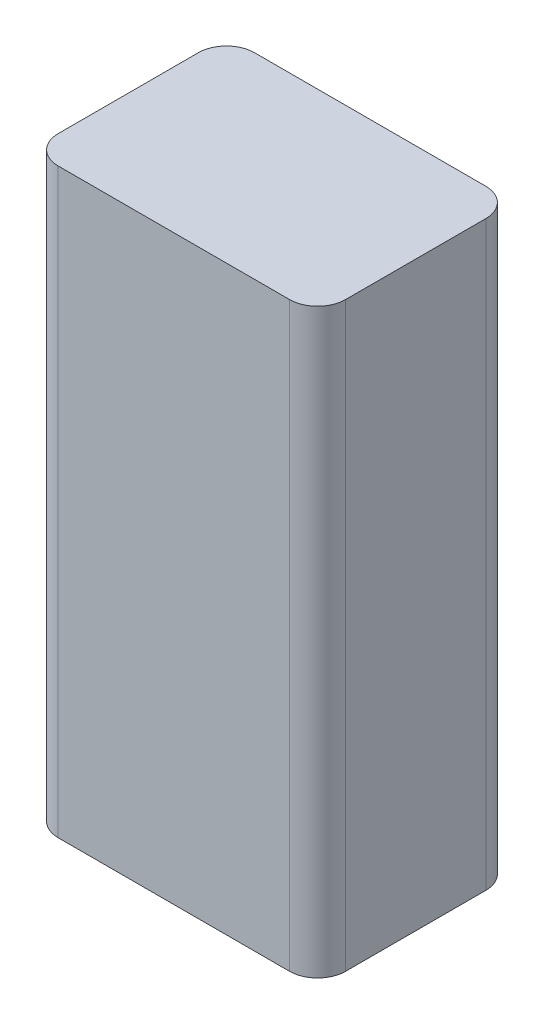
ISO-10303-21;
HEADER;
FILE_DESCRIPTION(('STEP AP214'),'2;1');
FILE_NAME('part.step','',(''),(''),'','','');
FILE_SCHEMA(('AUTOMOTIVE_DESIGN { 1 0 10303 214 1 1 1 1 }'));
ENDSEC;
DATA;
#1=APPLICATION_CONTEXT('core data for automotive mechanical design processes');
#2=APPLICATION_PROTOCOL_DEFINITION('international standard','automotive_design',2000,#1);
#3=PRODUCT_CONTEXT('',#1,'mechanical');
#4=PRODUCT('Part','Part','',(#3));
#5=PRODUCT_RELATED_PRODUCT_CATEGORY('part','',(#4));
#6=PRODUCT_DEFINITION_FORMATION('','',#4);
#7=PRODUCT_DEFINITION_CONTEXT('part definition',#1,'design');
#8=PRODUCT_DEFINITION('design','',#6,#7);
#9=PRODUCT_DEFINITION_SHAPE('','',#8);
#10=(LENGTH_UNIT() NAMED_UNIT(*) SI_UNIT(.MILLI.,.METRE.));
#11=(NAMED_UNIT(*) PLANE_ANGLE_UNIT() SI_UNIT($,.RADIAN.));
#12=(NAMED_UNIT(*) SI_UNIT($,.STERADIAN.) SOLID_ANGLE_UNIT());
#13=UNCERTAINTY_MEASURE_WITH_UNIT(LENGTH_MEASURE(1.E-05),#10,'distance_accuracy_value','');
#14=(GEOMETRIC_REPRESENTATION_CONTEXT(3) GLOBAL_UNCERTAINTY_ASSIGNED_CONTEXT((#13)) GLOBAL_UNIT_ASSIGNED_CONTEXT((#10,
#11,#12)) REPRESENTATION_CONTEXT('',''));
#15=CARTESIAN_POINT('',(0.,0.,0.));
#16=DIRECTION('',(0.,0.,1.));
#17=DIRECTION('',(1.,0.,0.));
#18=AXIS2_PLACEMENT_3D('',#15,#16,#17);
#19=CARTESIAN_POINT('',(0.,0.,17.78));
#20=DIRECTION('',(1.,0.,0.));
#21=DIRECTION('',(0.,1.,0.));
#22=AXIS2_PLACEMENT_3D('',#19,#20,#21);
#23=PLANE('',#22);
#24=DIRECTION('',(0.,0.,-1.));
#25=VECTOR('',#24,1.);
#26=CARTESIAN_POINT('',(0.,0.,17.78));
#27=LINE('',#26,#25);
#28=CARTESIAN_POINT('',(0.,0.,15.24));
#29=VERTEX_POINT('',#28);
#30=CARTESIAN_POINT('',(0.,0.,2.54));
#31=VERTEX_POINT('',#30);
#32=EDGE_CURVE('E150',#29,#31,#27,.T.);
#33=ORIENTED_EDGE('',*,*,#32,.T.);
#34=DIRECTION('',(0.,-1.,0.));
#35=VECTOR('',#34,1.);
#36=CARTESIAN_POINT('',(0.,0.,2.54));
#37=LINE('',#36,#35);
#38=CARTESIAN_POINT('',(0.,-52.705,2.54));
#39=VERTEX_POINT('',#38);
#40=EDGE_CURVE('E112',#31,#39,#37,.T.);
#41=ORIENTED_EDGE('',*,*,#40,.T.);
#42=DIRECTION('',(0.,0.,-1.));
#43=VECTOR('',#42,1.);
#44=CARTESIAN_POINT('',(0.,-52.705,17.78));
#45=LINE('',#44,#43);
#46=CARTESIAN_POINT('',(0.,-52.705,15.24));
#47=VERTEX_POINT('',#46);
#48=EDGE_CURVE('E104',#47,#39,#45,.T.);
#49=ORIENTED_EDGE('',*,*,#48,.F.);
#50=DIRECTION('',(0.,-1.,0.));
#51=VECTOR('',#50,1.);
#52=CARTESIAN_POINT('',(0.,0.,15.24));
#53=LINE('',#52,#51);
#54=EDGE_CURVE('E117',#47,#29,#53,.F.);
#55=ORIENTED_EDGE('',*,*,#54,.T.);
#56=EDGE_LOOP('',(#33,#41,#49,#55));
#57=FACE_BOUND('',#56,.T.);
#58=ADVANCED_FACE('F34',(#57),#23,.F.);
#59=CARTESIAN_POINT('',(0.,-52.705,17.78));
#60=DIRECTION('',(0.,1.,0.));
#61=DIRECTION('',(0.,0.,1.));
#62=AXIS2_PLACEMENT_3D('',#59,#60,#61);
#63=PLANE('',#62);
#64=ORIENTED_EDGE('',*,*,#48,.T.);
#65=CARTESIAN_POINT('',(2.54000000000002,-52.705,2.54));
#66=DIRECTION('',(0.,1.,0.));
#67=DIRECTION('',(0.,0.,1.));
#68=AXIS2_PLACEMENT_3D('',#65,#66,#67);
#69=CIRCLE('',#68,2.54);
#70=CARTESIAN_POINT('',(2.54000000000002,-52.705,0.));
#71=VERTEX_POINT('',#70);
#72=EDGE_CURVE('E131',#39,#71,#69,.F.);
#73=ORIENTED_EDGE('',*,*,#72,.T.);
#74=DIRECTION('',(1.,0.,0.));
#75=VECTOR('',#74,1.);
#76=CARTESIAN_POINT('',(0.,-52.705,0.));
#77=LINE('',#76,#75);
#78=CARTESIAN_POINT('',(23.495,-52.705,0.));
#79=VERTEX_POINT('',#78);
#80=EDGE_CURVE('E157',#71,#79,#77,.T.);
#81=ORIENTED_EDGE('',*,*,#80,.T.);
#82=CARTESIAN_POINT('',(23.495,-52.705,2.54));
#83=DIRECTION('',(0.,1.,0.));
#84=DIRECTION('',(0.,0.,1.));
#85=AXIS2_PLACEMENT_3D('',#82,#83,#84);
#86=CIRCLE('',#85,2.54);
#87=CARTESIAN_POINT('',(26.035,-52.705,2.54));
#88=VERTEX_POINT('',#87);
#89=EDGE_CURVE('E129',#79,#88,#86,.F.);
#90=ORIENTED_EDGE('',*,*,#89,.T.);
#91=DIRECTION('',(0.,0.,-1.));
#92=VECTOR('',#91,1.);
#93=CARTESIAN_POINT('',(26.035,-52.705,17.78));
#94=LINE('',#93,#92);
#95=CARTESIAN_POINT('',(26.035,-52.705,15.24));
#96=VERTEX_POINT('',#95);
#97=EDGE_CURVE('E120',#96,#88,#94,.T.);
#98=ORIENTED_EDGE('',*,*,#97,.F.);
#99=CARTESIAN_POINT('',(23.495,-52.705,15.24));
#100=DIRECTION('',(0.,1.,0.));
#101=DIRECTION('',(0.,0.,1.));
#102=AXIS2_PLACEMENT_3D('',#99,#100,#101);
#103=CIRCLE('',#102,2.54);
#104=CARTESIAN_POINT('',(23.495,-52.705,17.78));
#105=VERTEX_POINT('',#104);
#106=EDGE_CURVE('E111',#96,#105,#103,.F.);
#107=ORIENTED_EDGE('',*,*,#106,.T.);
#108=DIRECTION('',(1.,0.,0.));
#109=VECTOR('',#108,1.);
#110=CARTESIAN_POINT('',(0.,-52.705,17.78));
#111=LINE('',#110,#109);
#112=CARTESIAN_POINT('',(2.54000000000002,-52.705,17.78));
#113=VERTEX_POINT('',#112);
#114=EDGE_CURVE('E106',#113,#105,#111,.T.);
#115=ORIENTED_EDGE('',*,*,#114,.F.);
#116=CARTESIAN_POINT('',(2.54000000000002,-52.705,15.24));
#117=DIRECTION('',(0.,1.,0.));
#118=DIRECTION('',(0.,0.,1.));
#119=AXIS2_PLACEMENT_3D('',#116,#117,#118);
#120=CIRCLE('',#119,2.54);
#121=EDGE_CURVE('E101',#113,#47,#120,.F.);
#122=ORIENTED_EDGE('',*,*,#121,.T.);
#123=EDGE_LOOP('',(#64,#73,#81,#90,#98,#107,#115,#122));
#124=FACE_BOUND('',#123,.T.);
#125=ADVANCED_FACE('F103',(#124),#63,.F.);
#126=CARTESIAN_POINT('',(26.035,0.,17.78));
#127=DIRECTION('',(-1.,0.,0.));
#128=DIRECTION('',(0.,-1.,0.));
#129=AXIS2_PLACEMENT_3D('',#126,#127,#128);
#130=PLANE('',#129);
#131=ORIENTED_EDGE('',*,*,#97,.T.);
#132=DIRECTION('',(0.,1.,0.));
#133=VECTOR('',#132,1.);
#134=CARTESIAN_POINT('',(26.035,0.,2.54));
#135=LINE('',#134,#133);
#136=CARTESIAN_POINT('',(26.035,0.,2.54));
#137=VERTEX_POINT('',#136);
#138=EDGE_CURVE('E144',#88,#137,#135,.T.);
#139=ORIENTED_EDGE('',*,*,#138,.T.);
#140=DIRECTION('',(0.,0.,-1.));
#141=VECTOR('',#140,1.);
#142=CARTESIAN_POINT('',(26.035,0.,17.78));
#143=LINE('',#142,#141);
#144=CARTESIAN_POINT('',(26.035,0.,15.24));
#145=VERTEX_POINT('',#144);
#146=EDGE_CURVE('E152',#145,#137,#143,.T.);
#147=ORIENTED_EDGE('',*,*,#146,.F.);
#148=DIRECTION('',(0.,1.,0.));
#149=VECTOR('',#148,1.);
#150=CARTESIAN_POINT('',(26.035,-52.705,15.24));
#151=LINE('',#150,#149);
#152=EDGE_CURVE('E142',#145,#96,#151,.F.);
#153=ORIENTED_EDGE('',*,*,#152,.T.);
#154=EDGE_LOOP('',(#131,#139,#147,#153));
#155=FACE_BOUND('',#154,.T.);
#156=ADVANCED_FACE('F165',(#155),#130,.F.);
#157=CARTESIAN_POINT('',(0.,0.,17.78));
#158=DIRECTION('',(0.,-1.,0.));
#159=DIRECTION('',(0.,0.,-1.));
#160=AXIS2_PLACEMENT_3D('',#157,#158,#159);
#161=PLANE('',#160);
#162=DIRECTION('',(-1.,0.,0.));
#163=VECTOR('',#162,1.);
#164=CARTESIAN_POINT('',(0.,0.,0.));
#165=LINE('',#164,#163);
#166=CARTESIAN_POINT('',(23.495,0.,0.));
#167=VERTEX_POINT('',#166);
#168=CARTESIAN_POINT('',(2.54,0.,0.));
#169=VERTEX_POINT('',#168);
#170=EDGE_CURVE('E154',#167,#169,#165,.T.);
#171=ORIENTED_EDGE('',*,*,#170,.T.);
#172=CARTESIAN_POINT('',(2.54,0.,2.54));
#173=DIRECTION('',(0.,-1.,0.));
#174=DIRECTION('',(0.,0.,-1.));
#175=AXIS2_PLACEMENT_3D('',#172,#173,#174);
#176=CIRCLE('',#175,2.54);
#177=EDGE_CURVE('E140',#169,#31,#176,.F.);
#178=ORIENTED_EDGE('',*,*,#177,.T.);
#179=ORIENTED_EDGE('',*,*,#32,.F.);
#180=CARTESIAN_POINT('',(2.54,0.,15.24));
#181=DIRECTION('',(0.,-1.,0.));
#182=DIRECTION('',(0.,0.,-1.));
#183=AXIS2_PLACEMENT_3D('',#180,#181,#182);
#184=CIRCLE('',#183,2.54);
#185=CARTESIAN_POINT('',(2.54,0.,17.78));
#186=VERTEX_POINT('',#185);
#187=EDGE_CURVE('E123',#29,#186,#184,.F.);
#188=ORIENTED_EDGE('',*,*,#187,.T.);
#189=DIRECTION('',(-1.,0.,0.));
#190=VECTOR('',#189,1.);
#191=CARTESIAN_POINT('',(0.,0.,17.78));
#192=LINE('',#191,#190);
#193=CARTESIAN_POINT('',(23.495,0.,17.78));
#194=VERTEX_POINT('',#193);
#195=EDGE_CURVE('E149',#194,#186,#192,.T.);
#196=ORIENTED_EDGE('',*,*,#195,.F.);
#197=CARTESIAN_POINT('',(23.495,0.,15.24));
#198=DIRECTION('',(0.,-1.,0.));
#199=DIRECTION('',(0.,0.,-1.));
#200=AXIS2_PLACEMENT_3D('',#197,#198,#199);
#201=CIRCLE('',#200,2.54);
#202=EDGE_CURVE('E57',#194,#145,#201,.F.);
#203=ORIENTED_EDGE('',*,*,#202,.T.);
#204=ORIENTED_EDGE('',*,*,#146,.T.);
#205=CARTESIAN_POINT('',(23.495,0.,2.54));
#206=DIRECTION('',(0.,-1.,0.));
#207=DIRECTION('',(0.,0.,-1.));
#208=AXIS2_PLACEMENT_3D('',#205,#206,#207);
#209=CIRCLE('',#208,2.54);
#210=EDGE_CURVE('E49',#137,#167,#209,.F.);
#211=ORIENTED_EDGE('',*,*,#210,.T.);
#212=EDGE_LOOP('',(#171,#178,#179,#188,#196,#203,#204,#211));
#213=FACE_BOUND('',#212,.T.);
#214=ADVANCED_FACE('F178',(#213),#161,.F.);
#215=CARTESIAN_POINT('',(0.,0.,17.78));
#216=DIRECTION('',(0.,0.,1.));
#217=DIRECTION('',(1.,0.,0.));
#218=AXIS2_PLACEMENT_3D('',#215,#216,#217);
#219=PLANE('',#218);
#220=ORIENTED_EDGE('',*,*,#114,.T.);
#221=DIRECTION('',(0.,1.,0.));
#222=VECTOR('',#221,1.);
#223=CARTESIAN_POINT('',(23.495,0.,17.78));
#224=LINE('',#223,#222);
#225=EDGE_CURVE('E11',#105,#194,#224,.T.);
#226=ORIENTED_EDGE('',*,*,#225,.T.);
#227=ORIENTED_EDGE('',*,*,#195,.T.);
#228=DIRECTION('',(0.,-1.,0.));
#229=VECTOR('',#228,1.);
#230=CARTESIAN_POINT('',(2.54000000000002,-52.705,17.78));
#231=LINE('',#230,#229);
#232=EDGE_CURVE('E42',#186,#113,#231,.T.);
#233=ORIENTED_EDGE('',*,*,#232,.T.);
#234=EDGE_LOOP('',(#220,#226,#227,#233));
#235=FACE_BOUND('',#234,.T.);
#236=ADVANCED_FACE('F147',(#235),#219,.T.);
#237=CARTESIAN_POINT('',(0.,0.,0.));
#238=DIRECTION('',(0.,0.,1.));
#239=DIRECTION('',(1.,0.,0.));
#240=AXIS2_PLACEMENT_3D('',#237,#238,#239);
#241=PLANE('',#240);
#242=ORIENTED_EDGE('',*,*,#80,.F.);
#243=DIRECTION('',(0.,-1.,0.));
#244=VECTOR('',#243,1.);
#245=CARTESIAN_POINT('',(2.54,0.,0.));
#246=LINE('',#245,#244);
#247=EDGE_CURVE('E135',#71,#169,#246,.F.);
#248=ORIENTED_EDGE('',*,*,#247,.T.);
#249=ORIENTED_EDGE('',*,*,#170,.F.);
#250=DIRECTION('',(0.,1.,0.));
#251=VECTOR('',#250,1.);
#252=CARTESIAN_POINT('',(23.495,0.,0.));
#253=LINE('',#252,#251);
#254=EDGE_CURVE('E133',#167,#79,#253,.F.);
#255=ORIENTED_EDGE('',*,*,#254,.T.);
#256=EDGE_LOOP('',(#242,#248,#249,#255));
#257=FACE_BOUND('',#256,.T.);
#258=ADVANCED_FACE('F173',(#257),#241,.F.);
#259=CARTESIAN_POINT('',(2.54,0.,2.54));
#260=DIRECTION('',(0.,-1.,0.));
#261=DIRECTION('',(1.,0.,0.));
#262=AXIS2_PLACEMENT_3D('',#259,#260,#261);
#263=CYLINDRICAL_SURFACE('',#262,2.54);
#264=ORIENTED_EDGE('',*,*,#177,.F.);
#265=ORIENTED_EDGE('',*,*,#247,.F.);
#266=ORIENTED_EDGE('',*,*,#72,.F.);
#267=ORIENTED_EDGE('',*,*,#40,.F.);
#268=EDGE_LOOP('',(#264,#265,#266,#267));
#269=FACE_BOUND('',#268,.T.);
#270=ADVANCED_FACE('F177',(#269),#263,.T.);
#271=CARTESIAN_POINT('',(23.495,0.,2.54));
#272=DIRECTION('',(0.,1.,0.));
#273=DIRECTION('',(-1.,0.,0.));
#274=AXIS2_PLACEMENT_3D('',#271,#272,#273);
#275=CYLINDRICAL_SURFACE('',#274,2.54);
#276=ORIENTED_EDGE('',*,*,#89,.F.);
#277=ORIENTED_EDGE('',*,*,#254,.F.);
#278=ORIENTED_EDGE('',*,*,#210,.F.);
#279=ORIENTED_EDGE('',*,*,#138,.F.);
#280=EDGE_LOOP('',(#276,#277,#278,#279));
#281=FACE_BOUND('',#280,.T.);
#282=ADVANCED_FACE('F169',(#281),#275,.T.);
#283=CARTESIAN_POINT('',(23.495,0.,15.24));
#284=DIRECTION('',(0.,-1.,0.));
#285=DIRECTION('',(1.,0.,0.));
#286=AXIS2_PLACEMENT_3D('',#283,#284,#285);
#287=CYLINDRICAL_SURFACE('',#286,2.54);
#288=ORIENTED_EDGE('',*,*,#106,.F.);
#289=ORIENTED_EDGE('',*,*,#152,.F.);
#290=ORIENTED_EDGE('',*,*,#202,.F.);
#291=ORIENTED_EDGE('',*,*,#225,.F.);
#292=EDGE_LOOP('',(#288,#289,#290,#291));
#293=FACE_BOUND('',#292,.T.);
#294=ADVANCED_FACE('F180',(#293),#287,.T.);
#295=CARTESIAN_POINT('',(2.54,0.,15.24));
#296=DIRECTION('',(0.,1.,0.));
#297=DIRECTION('',(-1.,0.,0.));
#298=AXIS2_PLACEMENT_3D('',#295,#296,#297);
#299=CYLINDRICAL_SURFACE('',#298,2.54);
#300=ORIENTED_EDGE('',*,*,#187,.F.);
#301=ORIENTED_EDGE('',*,*,#54,.F.);
#302=ORIENTED_EDGE('',*,*,#121,.F.);
#303=ORIENTED_EDGE('',*,*,#232,.F.);
#304=EDGE_LOOP('',(#300,#301,#302,#303));
#305=FACE_BOUND('',#304,.T.);
#306=ADVANCED_FACE('F36',(#305),#299,.T.);
#307=CLOSED_SHELL('',(#58,#125,#156,#214,#236,#258,#270,#282,#294,#306));
#308=MANIFOLD_SOLID_BREP('B2',#307);
#309=ADVANCED_BREP_SHAPE_REPRESENTATION('',(#18,#308),#14);
#310=SHAPE_DEFINITION_REPRESENTATION(#9,#309);
ENDSEC;
END-ISO-10303-21;
